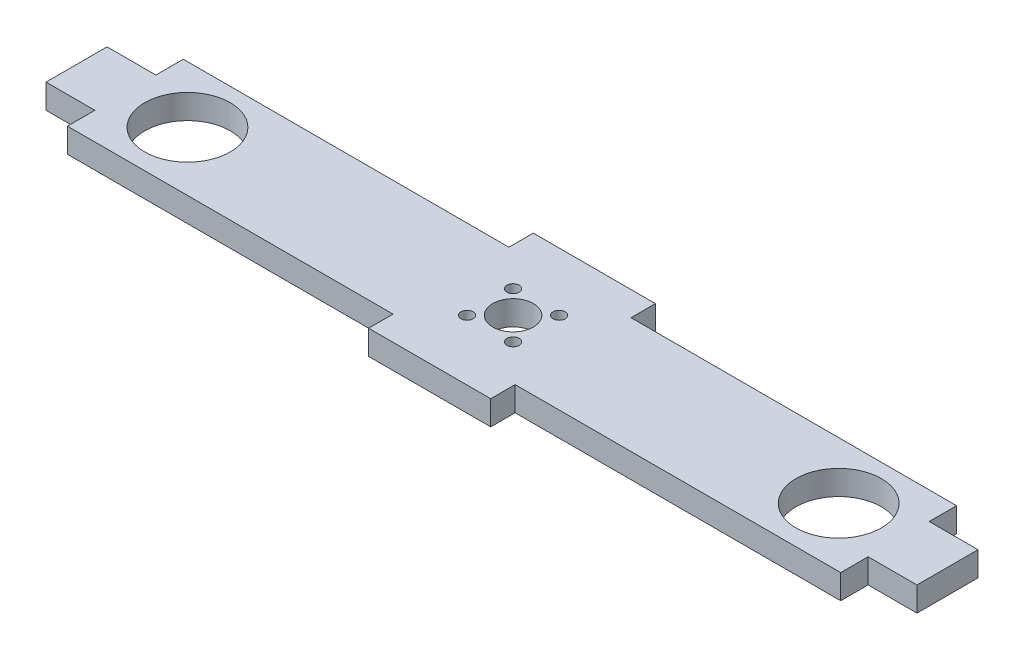
ISO-10303-21;
HEADER;
FILE_DESCRIPTION(('STEP AP214'),'2;1');
FILE_NAME('part.step','',(''),(''),'','','');
FILE_SCHEMA(('AUTOMOTIVE_DESIGN { 1 0 10303 214 1 1 1 1 }'));
ENDSEC;
DATA;
#1=APPLICATION_CONTEXT('core data for automotive mechanical design processes');
#2=APPLICATION_PROTOCOL_DEFINITION('international standard','automotive_design',2000,#1);
#3=PRODUCT_CONTEXT('',#1,'mechanical');
#4=PRODUCT('Part','Part','',(#3));
#5=PRODUCT_RELATED_PRODUCT_CATEGORY('part','',(#4));
#6=PRODUCT_DEFINITION_FORMATION('','',#4);
#7=PRODUCT_DEFINITION_CONTEXT('part definition',#1,'design');
#8=PRODUCT_DEFINITION('design','',#6,#7);
#9=PRODUCT_DEFINITION_SHAPE('','',#8);
#10=(LENGTH_UNIT() NAMED_UNIT(*) SI_UNIT(.MILLI.,.METRE.));
#11=(NAMED_UNIT(*) PLANE_ANGLE_UNIT() SI_UNIT($,.RADIAN.));
#12=(NAMED_UNIT(*) SI_UNIT($,.STERADIAN.) SOLID_ANGLE_UNIT());
#13=UNCERTAINTY_MEASURE_WITH_UNIT(LENGTH_MEASURE(1.E-05),#10,'distance_accuracy_value','');
#14=(GEOMETRIC_REPRESENTATION_CONTEXT(3) GLOBAL_UNCERTAINTY_ASSIGNED_CONTEXT((#13)) GLOBAL_UNIT_ASSIGNED_CONTEXT((#10,
#11,#12)) REPRESENTATION_CONTEXT('',''));
#15=CARTESIAN_POINT('',(0.,0.,0.));
#16=DIRECTION('',(0.,0.,1.));
#17=DIRECTION('',(1.,0.,0.));
#18=AXIS2_PLACEMENT_3D('',#15,#16,#17);
#19=CARTESIAN_POINT('',(0.,6.,0.));
#20=DIRECTION('',(0.,1.,0.));
#21=DIRECTION('',(0.,0.,1.));
#22=AXIS2_PLACEMENT_3D('',#19,#20,#21);
#23=PLANE('',#22);
#24=CARTESIAN_POINT('',(5.65685424949239,6.,5.39185424949239));
#25=DIRECTION('',(0.,1.,0.));
#26=DIRECTION('',(0.,0.,1.));
#27=AXIS2_PLACEMENT_3D('',#24,#25,#26);
#28=CIRCLE('',#27,1.5);
#29=CARTESIAN_POINT('',(5.65685424949239,6.,6.89185424949239));
#30=VERTEX_POINT('',#29);
#31=EDGE_CURVE('E409',#30,#30,#28,.T.);
#32=ORIENTED_EDGE('',*,*,#31,.F.);
#33=EDGE_LOOP('',(#32));
#34=FACE_BOUND('',#33,.T.);
#35=CARTESIAN_POINT('',(-5.65685424949238,6.,-5.92185424949236));
#36=DIRECTION('',(0.,1.,0.));
#37=DIRECTION('',(0.,0.,1.));
#38=AXIS2_PLACEMENT_3D('',#35,#36,#37);
#39=CIRCLE('',#38,1.5);
#40=CARTESIAN_POINT('',(-5.65685424949238,6.,-4.42185424949236));
#41=VERTEX_POINT('',#40);
#42=EDGE_CURVE('E421',#41,#41,#39,.T.);
#43=ORIENTED_EDGE('',*,*,#42,.F.);
#44=EDGE_LOOP('',(#43));
#45=FACE_BOUND('',#44,.T.);
#46=CARTESIAN_POINT('',(-80.,6.,-0.264999999999977));
#47=DIRECTION('',(0.,1.,0.));
#48=DIRECTION('',(0.,0.,1.));
#49=AXIS2_PLACEMENT_3D('',#46,#47,#48);
#50=CIRCLE('',#49,10.5);
#51=CARTESIAN_POINT('',(-80.,6.,10.235));
#52=VERTEX_POINT('',#51);
#53=EDGE_CURVE('E433',#52,#52,#50,.T.);
#54=ORIENTED_EDGE('',*,*,#53,.F.);
#55=EDGE_LOOP('',(#54));
#56=FACE_BOUND('',#55,.T.);
#57=DIRECTION('',(0.,0.,-1.));
#58=VECTOR('',#57,1.);
#59=CARTESIAN_POINT('',(95.,6.,7.5));
#60=LINE('',#59,#58);
#61=CARTESIAN_POINT('',(95.,6.,14.235));
#62=VERTEX_POINT('',#61);
#63=CARTESIAN_POINT('',(95.,6.,7.5));
#64=VERTEX_POINT('',#63);
#65=EDGE_CURVE('E243',#62,#64,#60,.T.);
#66=ORIENTED_EDGE('',*,*,#65,.T.);
#67=DIRECTION('',(1.,0.,0.));
#68=VECTOR('',#67,1.);
#69=CARTESIAN_POINT('',(95.,6.,7.5));
#70=LINE('',#69,#68);
#71=CARTESIAN_POINT('',(107.,6.,7.5));
#72=VERTEX_POINT('',#71);
#73=EDGE_CURVE('E131',#64,#72,#70,.T.);
#74=ORIENTED_EDGE('',*,*,#73,.T.);
#75=DIRECTION('',(0.,0.,-1.));
#76=VECTOR('',#75,1.);
#77=CARTESIAN_POINT('',(107.,6.,-7.5));
#78=LINE('',#77,#76);
#79=CARTESIAN_POINT('',(107.,6.,-7.5));
#80=VERTEX_POINT('',#79);
#81=EDGE_CURVE('E294',#72,#80,#78,.T.);
#82=ORIENTED_EDGE('',*,*,#81,.T.);
#83=DIRECTION('',(-1.,0.,0.));
#84=VECTOR('',#83,1.);
#85=CARTESIAN_POINT('',(95.,6.,-7.5));
#86=LINE('',#85,#84);
#87=CARTESIAN_POINT('',(95.,6.,-7.5));
#88=VERTEX_POINT('',#87);
#89=EDGE_CURVE('E313',#80,#88,#86,.T.);
#90=ORIENTED_EDGE('',*,*,#89,.T.);
#91=DIRECTION('',(0.,0.,-1.));
#92=VECTOR('',#91,1.);
#93=CARTESIAN_POINT('',(95.,6.,-14.235));
#94=LINE('',#93,#92);
#95=CARTESIAN_POINT('',(95.,6.,-14.235));
#96=VERTEX_POINT('',#95);
#97=EDGE_CURVE('E310',#88,#96,#94,.T.);
#98=ORIENTED_EDGE('',*,*,#97,.T.);
#99=DIRECTION('',(-1.,0.,0.));
#100=VECTOR('',#99,1.);
#101=CARTESIAN_POINT('',(15.,6.,-14.235));
#102=LINE('',#101,#100);
#103=CARTESIAN_POINT('',(15.,6.,-14.235));
#104=VERTEX_POINT('',#103);
#105=EDGE_CURVE('E312',#96,#104,#102,.T.);
#106=ORIENTED_EDGE('',*,*,#105,.T.);
#107=DIRECTION('',(0.,0.,-1.));
#108=VECTOR('',#107,1.);
#109=CARTESIAN_POINT('',(15.,6.,-20.235));
#110=LINE('',#109,#108);
#111=CARTESIAN_POINT('',(15.,6.,-20.235));
#112=VERTEX_POINT('',#111);
#113=EDGE_CURVE('E315',#104,#112,#110,.T.);
#114=ORIENTED_EDGE('',*,*,#113,.T.);
#115=DIRECTION('',(-1.,0.,0.));
#116=VECTOR('',#115,1.);
#117=CARTESIAN_POINT('',(-15.,6.,-20.235));
#118=LINE('',#117,#116);
#119=CARTESIAN_POINT('',(-15.,6.,-20.235));
#120=VERTEX_POINT('',#119);
#121=EDGE_CURVE('E321',#112,#120,#118,.T.);
#122=ORIENTED_EDGE('',*,*,#121,.T.);
#123=DIRECTION('',(0.,0.,1.));
#124=VECTOR('',#123,1.);
#125=CARTESIAN_POINT('',(-15.,6.,-20.235));
#126=LINE('',#125,#124);
#127=CARTESIAN_POINT('',(-15.,6.,-14.235));
#128=VERTEX_POINT('',#127);
#129=EDGE_CURVE('E323',#120,#128,#126,.T.);
#130=ORIENTED_EDGE('',*,*,#129,.T.);
#131=DIRECTION('',(-1.,0.,0.));
#132=VECTOR('',#131,1.);
#133=CARTESIAN_POINT('',(-95.,6.,-14.235));
#134=LINE('',#133,#132);
#135=CARTESIAN_POINT('',(-95.,6.,-14.235));
#136=VERTEX_POINT('',#135);
#137=EDGE_CURVE('E325',#128,#136,#134,.T.);
#138=ORIENTED_EDGE('',*,*,#137,.T.);
#139=DIRECTION('',(0.,0.,1.));
#140=VECTOR('',#139,1.);
#141=CARTESIAN_POINT('',(-95.,6.,-14.235));
#142=LINE('',#141,#140);
#143=CARTESIAN_POINT('',(-95.,6.,-7.49999999999997));
#144=VERTEX_POINT('',#143);
#145=EDGE_CURVE('E327',#136,#144,#142,.T.);
#146=ORIENTED_EDGE('',*,*,#145,.T.);
#147=DIRECTION('',(-1.,0.,0.));
#148=VECTOR('',#147,1.);
#149=CARTESIAN_POINT('',(-95.,6.,-7.49999999999997));
#150=LINE('',#149,#148);
#151=CARTESIAN_POINT('',(-107.,6.,-7.49999999999997));
#152=VERTEX_POINT('',#151);
#153=EDGE_CURVE('E329',#144,#152,#150,.T.);
#154=ORIENTED_EDGE('',*,*,#153,.T.);
#155=DIRECTION('',(0.,0.,1.));
#156=VECTOR('',#155,1.);
#157=CARTESIAN_POINT('',(-107.,6.,-7.49999999999997));
#158=LINE('',#157,#156);
#159=CARTESIAN_POINT('',(-107.,6.,7.50000000000003));
#160=VERTEX_POINT('',#159);
#161=EDGE_CURVE('E331',#152,#160,#158,.T.);
#162=ORIENTED_EDGE('',*,*,#161,.T.);
#163=DIRECTION('',(1.,0.,0.));
#164=VECTOR('',#163,1.);
#165=CARTESIAN_POINT('',(-95.,6.,7.50000000000003));
#166=LINE('',#165,#164);
#167=CARTESIAN_POINT('',(-95.,6.,7.50000000000003));
#168=VERTEX_POINT('',#167);
#169=EDGE_CURVE('E333',#160,#168,#166,.T.);
#170=ORIENTED_EDGE('',*,*,#169,.T.);
#171=DIRECTION('',(0.,0.,1.));
#172=VECTOR('',#171,1.);
#173=CARTESIAN_POINT('',(-95.,6.,7.50000000000003));
#174=LINE('',#173,#172);
#175=CARTESIAN_POINT('',(-95.,6.,14.235));
#176=VERTEX_POINT('',#175);
#177=EDGE_CURVE('E335',#168,#176,#174,.T.);
#178=ORIENTED_EDGE('',*,*,#177,.T.);
#179=DIRECTION('',(1.,0.,0.));
#180=VECTOR('',#179,1.);
#181=CARTESIAN_POINT('',(-95.,6.,14.235));
#182=LINE('',#181,#180);
#183=CARTESIAN_POINT('',(-15.,6.,14.235));
#184=VERTEX_POINT('',#183);
#185=EDGE_CURVE('E337',#176,#184,#182,.T.);
#186=ORIENTED_EDGE('',*,*,#185,.T.);
#187=DIRECTION('',(0.,0.,1.));
#188=VECTOR('',#187,1.);
#189=CARTESIAN_POINT('',(-15.,6.,14.235));
#190=LINE('',#189,#188);
#191=CARTESIAN_POINT('',(-15.,6.,20.235));
#192=VERTEX_POINT('',#191);
#193=EDGE_CURVE('E186',#184,#192,#190,.T.);
#194=ORIENTED_EDGE('',*,*,#193,.T.);
#195=DIRECTION('',(1.,0.,0.));
#196=VECTOR('',#195,1.);
#197=CARTESIAN_POINT('',(-15.,6.,20.235));
#198=LINE('',#197,#196);
#199=CARTESIAN_POINT('',(15.,6.,20.235));
#200=VERTEX_POINT('',#199);
#201=EDGE_CURVE('E180',#192,#200,#198,.T.);
#202=ORIENTED_EDGE('',*,*,#201,.T.);
#203=DIRECTION('',(0.,0.,-1.));
#204=VECTOR('',#203,1.);
#205=CARTESIAN_POINT('',(15.,6.,14.235));
#206=LINE('',#205,#204);
#207=CARTESIAN_POINT('',(15.,6.,14.235));
#208=VERTEX_POINT('',#207);
#209=EDGE_CURVE('E184',#200,#208,#206,.T.);
#210=ORIENTED_EDGE('',*,*,#209,.T.);
#211=DIRECTION('',(1.,0.,0.));
#212=VECTOR('',#211,1.);
#213=CARTESIAN_POINT('',(15.,6.,14.235));
#214=LINE('',#213,#212);
#215=EDGE_CURVE('E52',#208,#62,#214,.T.);
#216=ORIENTED_EDGE('',*,*,#215,.T.);
#217=EDGE_LOOP('',(#66,#74,#82,#90,#98,#106,#114,#122,#130,#138,#146,#154,#162,#170,#178,#186,
#194,#202,#210,#216));
#218=FACE_BOUND('',#217,.T.);
#219=CARTESIAN_POINT('',(0.,6.,-0.264999999999987));
#220=DIRECTION('',(0.,1.,0.));
#221=DIRECTION('',(0.,0.,1.));
#222=AXIS2_PLACEMENT_3D('',#219,#220,#221);
#223=CIRCLE('',#222,5.);
#224=CARTESIAN_POINT('',(0.,6.,4.73500000000001));
#225=VERTEX_POINT('',#224);
#226=EDGE_CURVE('E208',#225,#225,#223,.T.);
#227=ORIENTED_EDGE('',*,*,#226,.F.);
#228=EDGE_LOOP('',(#227));
#229=FACE_BOUND('',#228,.T.);
#230=CARTESIAN_POINT('',(80.,6.,-0.264999999999977));
#231=DIRECTION('',(0.,1.,0.));
#232=DIRECTION('',(0.,0.,-1.));
#233=AXIS2_PLACEMENT_3D('',#230,#231,#232);
#234=CIRCLE('',#233,10.5);
#235=CARTESIAN_POINT('',(80.,6.,-10.765));
#236=VERTEX_POINT('',#235);
#237=EDGE_CURVE('E427',#236,#236,#234,.T.);
#238=ORIENTED_EDGE('',*,*,#237,.F.);
#239=EDGE_LOOP('',(#238));
#240=FACE_BOUND('',#239,.T.);
#241=CARTESIAN_POINT('',(5.65685424949239,6.,-5.92185424949237));
#242=DIRECTION('',(0.,1.,0.));
#243=DIRECTION('',(0.,0.,-1.));
#244=AXIS2_PLACEMENT_3D('',#241,#242,#243);
#245=CIRCLE('',#244,1.5);
#246=CARTESIAN_POINT('',(5.65685424949239,6.,-7.42185424949237));
#247=VERTEX_POINT('',#246);
#248=EDGE_CURVE('E415',#247,#247,#245,.T.);
#249=ORIENTED_EDGE('',*,*,#248,.F.);
#250=EDGE_LOOP('',(#249));
#251=FACE_BOUND('',#250,.T.);
#252=CARTESIAN_POINT('',(-5.65685424949238,6.,5.39185424949239));
#253=DIRECTION('',(0.,1.,0.));
#254=DIRECTION('',(0.,0.,-1.));
#255=AXIS2_PLACEMENT_3D('',#252,#253,#254);
#256=CIRCLE('',#255,1.5);
#257=CARTESIAN_POINT('',(-5.65685424949238,6.,3.89185424949239));
#258=VERTEX_POINT('',#257);
#259=EDGE_CURVE('E400',#258,#258,#256,.T.);
#260=ORIENTED_EDGE('',*,*,#259,.F.);
#261=EDGE_LOOP('',(#260));
#262=FACE_BOUND('',#261,.T.);
#263=ADVANCED_FACE('F35',(#34,#45,#56,#218,#229,#240,#251,#262),#23,.T.);
#264=CARTESIAN_POINT('',(0.,0.,0.));
#265=DIRECTION('',(0.,1.,0.));
#266=DIRECTION('',(0.,0.,1.));
#267=AXIS2_PLACEMENT_3D('',#264,#265,#266);
#268=PLANE('',#267);
#269=DIRECTION('',(0.,0.,-1.));
#270=VECTOR('',#269,1.);
#271=CARTESIAN_POINT('',(95.,0.,7.5));
#272=LINE('',#271,#270);
#273=CARTESIAN_POINT('',(95.,0.,14.235));
#274=VERTEX_POINT('',#273);
#275=CARTESIAN_POINT('',(95.,0.,7.5));
#276=VERTEX_POINT('',#275);
#277=EDGE_CURVE('E204',#274,#276,#272,.T.);
#278=ORIENTED_EDGE('',*,*,#277,.F.);
#279=DIRECTION('',(1.,0.,0.));
#280=VECTOR('',#279,1.);
#281=CARTESIAN_POINT('',(15.,0.,14.235));
#282=LINE('',#281,#280);
#283=CARTESIAN_POINT('',(15.,0.,14.235));
#284=VERTEX_POINT('',#283);
#285=EDGE_CURVE('E123',#284,#274,#282,.T.);
#286=ORIENTED_EDGE('',*,*,#285,.F.);
#287=DIRECTION('',(0.,0.,-1.));
#288=VECTOR('',#287,1.);
#289=CARTESIAN_POINT('',(15.,0.,14.235));
#290=LINE('',#289,#288);
#291=CARTESIAN_POINT('',(15.,0.,20.235));
#292=VERTEX_POINT('',#291);
#293=EDGE_CURVE('E117',#292,#284,#290,.T.);
#294=ORIENTED_EDGE('',*,*,#293,.F.);
#295=DIRECTION('',(1.,0.,0.));
#296=VECTOR('',#295,1.);
#297=CARTESIAN_POINT('',(-15.,0.,20.235));
#298=LINE('',#297,#296);
#299=CARTESIAN_POINT('',(-15.,0.,20.235));
#300=VERTEX_POINT('',#299);
#301=EDGE_CURVE('E194',#300,#292,#298,.T.);
#302=ORIENTED_EDGE('',*,*,#301,.F.);
#303=DIRECTION('',(0.,0.,1.));
#304=VECTOR('',#303,1.);
#305=CARTESIAN_POINT('',(-15.,0.,14.235));
#306=LINE('',#305,#304);
#307=CARTESIAN_POINT('',(-15.,0.,14.235));
#308=VERTEX_POINT('',#307);
#309=EDGE_CURVE('E238',#308,#300,#306,.T.);
#310=ORIENTED_EDGE('',*,*,#309,.F.);
#311=DIRECTION('',(1.,0.,0.));
#312=VECTOR('',#311,1.);
#313=CARTESIAN_POINT('',(-95.,0.,14.235));
#314=LINE('',#313,#312);
#315=CARTESIAN_POINT('',(-95.,0.,14.235));
#316=VERTEX_POINT('',#315);
#317=EDGE_CURVE('E236',#316,#308,#314,.T.);
#318=ORIENTED_EDGE('',*,*,#317,.F.);
#319=DIRECTION('',(0.,0.,1.));
#320=VECTOR('',#319,1.);
#321=CARTESIAN_POINT('',(-95.,0.,7.50000000000003));
#322=LINE('',#321,#320);
#323=CARTESIAN_POINT('',(-95.,0.,7.50000000000003));
#324=VERTEX_POINT('',#323);
#325=EDGE_CURVE('E234',#324,#316,#322,.T.);
#326=ORIENTED_EDGE('',*,*,#325,.F.);
#327=DIRECTION('',(1.,0.,0.));
#328=VECTOR('',#327,1.);
#329=CARTESIAN_POINT('',(-95.,0.,7.50000000000003));
#330=LINE('',#329,#328);
#331=CARTESIAN_POINT('',(-107.,0.,7.50000000000003));
#332=VERTEX_POINT('',#331);
#333=EDGE_CURVE('E232',#332,#324,#330,.T.);
#334=ORIENTED_EDGE('',*,*,#333,.F.);
#335=DIRECTION('',(0.,0.,1.));
#336=VECTOR('',#335,1.);
#337=CARTESIAN_POINT('',(-107.,0.,-7.49999999999997));
#338=LINE('',#337,#336);
#339=CARTESIAN_POINT('',(-107.,0.,-7.49999999999997));
#340=VERTEX_POINT('',#339);
#341=EDGE_CURVE('E230',#340,#332,#338,.T.);
#342=ORIENTED_EDGE('',*,*,#341,.F.);
#343=DIRECTION('',(-1.,0.,0.));
#344=VECTOR('',#343,1.);
#345=CARTESIAN_POINT('',(-95.,0.,-7.49999999999997));
#346=LINE('',#345,#344);
#347=CARTESIAN_POINT('',(-95.,0.,-7.49999999999997));
#348=VERTEX_POINT('',#347);
#349=EDGE_CURVE('E228',#348,#340,#346,.T.);
#350=ORIENTED_EDGE('',*,*,#349,.F.);
#351=DIRECTION('',(0.,0.,1.));
#352=VECTOR('',#351,1.);
#353=CARTESIAN_POINT('',(-95.,0.,-14.235));
#354=LINE('',#353,#352);
#355=CARTESIAN_POINT('',(-95.,0.,-14.235));
#356=VERTEX_POINT('',#355);
#357=EDGE_CURVE('E226',#356,#348,#354,.T.);
#358=ORIENTED_EDGE('',*,*,#357,.F.);
#359=DIRECTION('',(-1.,0.,0.));
#360=VECTOR('',#359,1.);
#361=CARTESIAN_POINT('',(-95.,0.,-14.235));
#362=LINE('',#361,#360);
#363=CARTESIAN_POINT('',(-15.,0.,-14.235));
#364=VERTEX_POINT('',#363);
#365=EDGE_CURVE('E224',#364,#356,#362,.T.);
#366=ORIENTED_EDGE('',*,*,#365,.F.);
#367=DIRECTION('',(0.,0.,1.));
#368=VECTOR('',#367,1.);
#369=CARTESIAN_POINT('',(-15.,0.,-20.235));
#370=LINE('',#369,#368);
#371=CARTESIAN_POINT('',(-15.,0.,-20.235));
#372=VERTEX_POINT('',#371);
#373=EDGE_CURVE('E222',#372,#364,#370,.T.);
#374=ORIENTED_EDGE('',*,*,#373,.F.);
#375=DIRECTION('',(-1.,0.,0.));
#376=VECTOR('',#375,1.);
#377=CARTESIAN_POINT('',(-15.,0.,-20.235));
#378=LINE('',#377,#376);
#379=CARTESIAN_POINT('',(15.,0.,-20.235));
#380=VERTEX_POINT('',#379);
#381=EDGE_CURVE('E220',#380,#372,#378,.T.);
#382=ORIENTED_EDGE('',*,*,#381,.F.);
#383=DIRECTION('',(0.,0.,-1.));
#384=VECTOR('',#383,1.);
#385=CARTESIAN_POINT('',(15.,0.,-20.235));
#386=LINE('',#385,#384);
#387=CARTESIAN_POINT('',(15.,0.,-14.235));
#388=VERTEX_POINT('',#387);
#389=EDGE_CURVE('E218',#388,#380,#386,.T.);
#390=ORIENTED_EDGE('',*,*,#389,.F.);
#391=DIRECTION('',(-1.,0.,0.));
#392=VECTOR('',#391,1.);
#393=CARTESIAN_POINT('',(15.,0.,-14.235));
#394=LINE('',#393,#392);
#395=CARTESIAN_POINT('',(95.,0.,-14.235));
#396=VERTEX_POINT('',#395);
#397=EDGE_CURVE('E216',#396,#388,#394,.T.);
#398=ORIENTED_EDGE('',*,*,#397,.F.);
#399=DIRECTION('',(0.,0.,-1.));
#400=VECTOR('',#399,1.);
#401=CARTESIAN_POINT('',(95.,0.,-14.235));
#402=LINE('',#401,#400);
#403=CARTESIAN_POINT('',(95.,0.,-7.5));
#404=VERTEX_POINT('',#403);
#405=EDGE_CURVE('E214',#404,#396,#402,.T.);
#406=ORIENTED_EDGE('',*,*,#405,.F.);
#407=DIRECTION('',(-1.,0.,0.));
#408=VECTOR('',#407,1.);
#409=CARTESIAN_POINT('',(95.,0.,-7.5));
#410=LINE('',#409,#408);
#411=CARTESIAN_POINT('',(107.,0.,-7.5));
#412=VERTEX_POINT('',#411);
#413=EDGE_CURVE('E212',#412,#404,#410,.T.);
#414=ORIENTED_EDGE('',*,*,#413,.F.);
#415=DIRECTION('',(0.,0.,-1.));
#416=VECTOR('',#415,1.);
#417=CARTESIAN_POINT('',(107.,0.,-7.5));
#418=LINE('',#417,#416);
#419=CARTESIAN_POINT('',(107.,0.,7.5));
#420=VERTEX_POINT('',#419);
#421=EDGE_CURVE('E210',#420,#412,#418,.T.);
#422=ORIENTED_EDGE('',*,*,#421,.F.);
#423=DIRECTION('',(1.,0.,0.));
#424=VECTOR('',#423,1.);
#425=CARTESIAN_POINT('',(95.,0.,7.5));
#426=LINE('',#425,#424);
#427=EDGE_CURVE('E207',#276,#420,#426,.T.);
#428=ORIENTED_EDGE('',*,*,#427,.F.);
#429=EDGE_LOOP('',(#278,#286,#294,#302,#310,#318,#326,#334,#342,#350,#358,#366,#374,#382,#390,
#398,#406,#414,#422,#428));
#430=FACE_BOUND('',#429,.T.);
#431=CARTESIAN_POINT('',(0.,0.,-0.264999999999987));
#432=DIRECTION('',(0.,1.,0.));
#433=DIRECTION('',(0.,0.,1.));
#434=AXIS2_PLACEMENT_3D('',#431,#432,#433);
#435=CIRCLE('',#434,5.);
#436=CARTESIAN_POINT('',(0.,0.,4.73500000000001));
#437=VERTEX_POINT('',#436);
#438=EDGE_CURVE('E436',#437,#437,#435,.T.);
#439=ORIENTED_EDGE('',*,*,#438,.T.);
#440=EDGE_LOOP('',(#439));
#441=FACE_BOUND('',#440,.T.);
#442=CARTESIAN_POINT('',(-80.,0.,-0.264999999999977));
#443=DIRECTION('',(0.,1.,0.));
#444=DIRECTION('',(0.,0.,1.));
#445=AXIS2_PLACEMENT_3D('',#442,#443,#444);
#446=CIRCLE('',#445,10.5);
#447=CARTESIAN_POINT('',(-80.,0.,10.235));
#448=VERTEX_POINT('',#447);
#449=EDGE_CURVE('E430',#448,#448,#446,.T.);
#450=ORIENTED_EDGE('',*,*,#449,.T.);
#451=EDGE_LOOP('',(#450));
#452=FACE_BOUND('',#451,.T.);
#453=CARTESIAN_POINT('',(80.,0.,-0.264999999999977));
#454=DIRECTION('',(0.,1.,0.));
#455=DIRECTION('',(0.,0.,-1.));
#456=AXIS2_PLACEMENT_3D('',#453,#454,#455);
#457=CIRCLE('',#456,10.5);
#458=CARTESIAN_POINT('',(80.,0.,-10.765));
#459=VERTEX_POINT('',#458);
#460=EDGE_CURVE('E424',#459,#459,#457,.T.);
#461=ORIENTED_EDGE('',*,*,#460,.T.);
#462=EDGE_LOOP('',(#461));
#463=FACE_BOUND('',#462,.T.);
#464=CARTESIAN_POINT('',(-5.65685424949238,0.,-5.92185424949236));
#465=DIRECTION('',(0.,1.,0.));
#466=DIRECTION('',(0.,0.,1.));
#467=AXIS2_PLACEMENT_3D('',#464,#465,#466);
#468=CIRCLE('',#467,1.5);
#469=CARTESIAN_POINT('',(-5.65685424949238,0.,-4.42185424949236));
#470=VERTEX_POINT('',#469);
#471=EDGE_CURVE('E418',#470,#470,#468,.T.);
#472=ORIENTED_EDGE('',*,*,#471,.T.);
#473=EDGE_LOOP('',(#472));
#474=FACE_BOUND('',#473,.T.);
#475=CARTESIAN_POINT('',(5.65685424949239,0.,-5.92185424949237));
#476=DIRECTION('',(0.,1.,0.));
#477=DIRECTION('',(0.,0.,-1.));
#478=AXIS2_PLACEMENT_3D('',#475,#476,#477);
#479=CIRCLE('',#478,1.5);
#480=CARTESIAN_POINT('',(5.65685424949239,0.,-7.42185424949237));
#481=VERTEX_POINT('',#480);
#482=EDGE_CURVE('E412',#481,#481,#479,.T.);
#483=ORIENTED_EDGE('',*,*,#482,.T.);
#484=EDGE_LOOP('',(#483));
#485=FACE_BOUND('',#484,.T.);
#486=CARTESIAN_POINT('',(5.65685424949239,0.,5.39185424949239));
#487=DIRECTION('',(0.,1.,0.));
#488=DIRECTION('',(0.,0.,1.));
#489=AXIS2_PLACEMENT_3D('',#486,#487,#488);
#490=CIRCLE('',#489,1.5);
#491=CARTESIAN_POINT('',(5.65685424949239,0.,6.89185424949239));
#492=VERTEX_POINT('',#491);
#493=EDGE_CURVE('E406',#492,#492,#490,.T.);
#494=ORIENTED_EDGE('',*,*,#493,.T.);
#495=EDGE_LOOP('',(#494));
#496=FACE_BOUND('',#495,.T.);
#497=CARTESIAN_POINT('',(-5.65685424949238,0.,5.39185424949239));
#498=DIRECTION('',(0.,1.,0.));
#499=DIRECTION('',(0.,0.,-1.));
#500=AXIS2_PLACEMENT_3D('',#497,#498,#499);
#501=CIRCLE('',#500,1.5);
#502=CARTESIAN_POINT('',(-5.65685424949238,0.,3.89185424949239));
#503=VERTEX_POINT('',#502);
#504=EDGE_CURVE('E403',#503,#503,#501,.T.);
#505=ORIENTED_EDGE('',*,*,#504,.T.);
#506=EDGE_LOOP('',(#505));
#507=FACE_BOUND('',#506,.T.);
#508=ADVANCED_FACE('F298',(#430,#441,#452,#463,#474,#485,#496,#507),#268,.F.);
#509=CARTESIAN_POINT('',(95.,6.,7.5));
#510=DIRECTION('',(-1.,0.,0.));
#511=DIRECTION('',(0.,0.,1.));
#512=AXIS2_PLACEMENT_3D('',#509,#510,#511);
#513=PLANE('',#512);
#514=ORIENTED_EDGE('',*,*,#277,.T.);
#515=DIRECTION('',(0.,-1.,0.));
#516=VECTOR('',#515,1.);
#517=CARTESIAN_POINT('',(95.,6.,7.5));
#518=LINE('',#517,#516);
#519=EDGE_CURVE('E11',#64,#276,#518,.T.);
#520=ORIENTED_EDGE('',*,*,#519,.F.);
#521=ORIENTED_EDGE('',*,*,#65,.F.);
#522=DIRECTION('',(0.,-1.,0.));
#523=VECTOR('',#522,1.);
#524=CARTESIAN_POINT('',(95.,6.,14.235));
#525=LINE('',#524,#523);
#526=EDGE_CURVE('E200',#62,#274,#525,.T.);
#527=ORIENTED_EDGE('',*,*,#526,.T.);
#528=EDGE_LOOP('',(#514,#520,#521,#527));
#529=FACE_BOUND('',#528,.T.);
#530=ADVANCED_FACE('F37',(#529),#513,.F.);
#531=CARTESIAN_POINT('',(95.,6.,7.5));
#532=DIRECTION('',(0.,0.,-1.));
#533=DIRECTION('',(-1.,0.,0.));
#534=AXIS2_PLACEMENT_3D('',#531,#532,#533);
#535=PLANE('',#534);
#536=ORIENTED_EDGE('',*,*,#427,.T.);
#537=DIRECTION('',(0.,-1.,0.));
#538=VECTOR('',#537,1.);
#539=CARTESIAN_POINT('',(107.,6.,7.5));
#540=LINE('',#539,#538);
#541=EDGE_CURVE('E44',#72,#420,#540,.T.);
#542=ORIENTED_EDGE('',*,*,#541,.F.);
#543=ORIENTED_EDGE('',*,*,#73,.F.);
#544=ORIENTED_EDGE('',*,*,#519,.T.);
#545=EDGE_LOOP('',(#536,#542,#543,#544));
#546=FACE_BOUND('',#545,.T.);
#547=ADVANCED_FACE('F653',(#546),#535,.F.);
#548=CARTESIAN_POINT('',(107.,6.,-7.5));
#549=DIRECTION('',(-1.,0.,0.));
#550=DIRECTION('',(0.,0.,1.));
#551=AXIS2_PLACEMENT_3D('',#548,#549,#550);
#552=PLANE('',#551);
#553=ORIENTED_EDGE('',*,*,#421,.T.);
#554=DIRECTION('',(0.,-1.,0.));
#555=VECTOR('',#554,1.);
#556=CARTESIAN_POINT('',(107.,6.,-7.5));
#557=LINE('',#556,#555);
#558=EDGE_CURVE('E286',#80,#412,#557,.T.);
#559=ORIENTED_EDGE('',*,*,#558,.F.);
#560=ORIENTED_EDGE('',*,*,#81,.F.);
#561=ORIENTED_EDGE('',*,*,#541,.T.);
#562=EDGE_LOOP('',(#553,#559,#560,#561));
#563=FACE_BOUND('',#562,.T.);
#564=ADVANCED_FACE('F292',(#563),#552,.F.);
#565=CARTESIAN_POINT('',(95.,6.,-7.5));
#566=DIRECTION('',(0.,0.,1.));
#567=DIRECTION('',(1.,0.,0.));
#568=AXIS2_PLACEMENT_3D('',#565,#566,#567);
#569=PLANE('',#568);
#570=ORIENTED_EDGE('',*,*,#413,.T.);
#571=DIRECTION('',(0.,-1.,0.));
#572=VECTOR('',#571,1.);
#573=CARTESIAN_POINT('',(95.,6.,-7.5));
#574=LINE('',#573,#572);
#575=EDGE_CURVE('E283',#88,#404,#574,.T.);
#576=ORIENTED_EDGE('',*,*,#575,.F.);
#577=ORIENTED_EDGE('',*,*,#89,.F.);
#578=ORIENTED_EDGE('',*,*,#558,.T.);
#579=EDGE_LOOP('',(#570,#576,#577,#578));
#580=FACE_BOUND('',#579,.T.);
#581=ADVANCED_FACE('F304',(#580),#569,.F.);
#582=CARTESIAN_POINT('',(95.,6.,-14.235));
#583=DIRECTION('',(-1.,0.,0.));
#584=DIRECTION('',(0.,0.,1.));
#585=AXIS2_PLACEMENT_3D('',#582,#583,#584);
#586=PLANE('',#585);
#587=ORIENTED_EDGE('',*,*,#405,.T.);
#588=DIRECTION('',(0.,-1.,0.));
#589=VECTOR('',#588,1.);
#590=CARTESIAN_POINT('',(95.,6.,-14.235));
#591=LINE('',#590,#589);
#592=EDGE_CURVE('E280',#96,#396,#591,.T.);
#593=ORIENTED_EDGE('',*,*,#592,.F.);
#594=ORIENTED_EDGE('',*,*,#97,.F.);
#595=ORIENTED_EDGE('',*,*,#575,.T.);
#596=EDGE_LOOP('',(#587,#593,#594,#595));
#597=FACE_BOUND('',#596,.T.);
#598=ADVANCED_FACE('F308',(#597),#586,.F.);
#599=CARTESIAN_POINT('',(15.,6.,-14.235));
#600=DIRECTION('',(0.,0.,1.));
#601=DIRECTION('',(1.,0.,0.));
#602=AXIS2_PLACEMENT_3D('',#599,#600,#601);
#603=PLANE('',#602);
#604=ORIENTED_EDGE('',*,*,#397,.T.);
#605=DIRECTION('',(0.,-1.,0.));
#606=VECTOR('',#605,1.);
#607=CARTESIAN_POINT('',(15.,6.,-14.235));
#608=LINE('',#607,#606);
#609=EDGE_CURVE('E277',#104,#388,#608,.T.);
#610=ORIENTED_EDGE('',*,*,#609,.F.);
#611=ORIENTED_EDGE('',*,*,#105,.F.);
#612=ORIENTED_EDGE('',*,*,#592,.T.);
#613=EDGE_LOOP('',(#604,#610,#611,#612));
#614=FACE_BOUND('',#613,.T.);
#615=ADVANCED_FACE('F618',(#614),#603,.F.);
#616=CARTESIAN_POINT('',(15.,6.,-20.235));
#617=DIRECTION('',(-1.,0.,0.));
#618=DIRECTION('',(0.,0.,1.));
#619=AXIS2_PLACEMENT_3D('',#616,#617,#618);
#620=PLANE('',#619);
#621=ORIENTED_EDGE('',*,*,#389,.T.);
#622=DIRECTION('',(0.,-1.,0.));
#623=VECTOR('',#622,1.);
#624=CARTESIAN_POINT('',(15.,6.,-20.235));
#625=LINE('',#624,#623);
#626=EDGE_CURVE('E274',#112,#380,#625,.T.);
#627=ORIENTED_EDGE('',*,*,#626,.F.);
#628=ORIENTED_EDGE('',*,*,#113,.F.);
#629=ORIENTED_EDGE('',*,*,#609,.T.);
#630=EDGE_LOOP('',(#621,#627,#628,#629));
#631=FACE_BOUND('',#630,.T.);
#632=ADVANCED_FACE('F608',(#631),#620,.F.);
#633=CARTESIAN_POINT('',(-15.,6.,-20.235));
#634=DIRECTION('',(0.,0.,1.));
#635=DIRECTION('',(1.,0.,0.));
#636=AXIS2_PLACEMENT_3D('',#633,#634,#635);
#637=PLANE('',#636);
#638=ORIENTED_EDGE('',*,*,#381,.T.);
#639=DIRECTION('',(0.,-1.,0.));
#640=VECTOR('',#639,1.);
#641=CARTESIAN_POINT('',(-15.,6.,-20.235));
#642=LINE('',#641,#640);
#643=EDGE_CURVE('E271',#120,#372,#642,.T.);
#644=ORIENTED_EDGE('',*,*,#643,.F.);
#645=ORIENTED_EDGE('',*,*,#121,.F.);
#646=ORIENTED_EDGE('',*,*,#626,.T.);
#647=EDGE_LOOP('',(#638,#644,#645,#646));
#648=FACE_BOUND('',#647,.T.);
#649=ADVANCED_FACE('F598',(#648),#637,.F.);
#650=CARTESIAN_POINT('',(-15.,6.,-20.235));
#651=DIRECTION('',(1.,0.,0.));
#652=DIRECTION('',(0.,0.,-1.));
#653=AXIS2_PLACEMENT_3D('',#650,#651,#652);
#654=PLANE('',#653);
#655=ORIENTED_EDGE('',*,*,#373,.T.);
#656=DIRECTION('',(0.,-1.,0.));
#657=VECTOR('',#656,1.);
#658=CARTESIAN_POINT('',(-15.,6.,-14.235));
#659=LINE('',#658,#657);
#660=EDGE_CURVE('E268',#128,#364,#659,.T.);
#661=ORIENTED_EDGE('',*,*,#660,.F.);
#662=ORIENTED_EDGE('',*,*,#129,.F.);
#663=ORIENTED_EDGE('',*,*,#643,.T.);
#664=EDGE_LOOP('',(#655,#661,#662,#663));
#665=FACE_BOUND('',#664,.T.);
#666=ADVANCED_FACE('F588',(#665),#654,.F.);
#667=CARTESIAN_POINT('',(-95.,6.,-14.235));
#668=DIRECTION('',(0.,0.,1.));
#669=DIRECTION('',(1.,0.,0.));
#670=AXIS2_PLACEMENT_3D('',#667,#668,#669);
#671=PLANE('',#670);
#672=ORIENTED_EDGE('',*,*,#365,.T.);
#673=DIRECTION('',(0.,-1.,0.));
#674=VECTOR('',#673,1.);
#675=CARTESIAN_POINT('',(-95.,6.,-14.235));
#676=LINE('',#675,#674);
#677=EDGE_CURVE('E265',#136,#356,#676,.T.);
#678=ORIENTED_EDGE('',*,*,#677,.F.);
#679=ORIENTED_EDGE('',*,*,#137,.F.);
#680=ORIENTED_EDGE('',*,*,#660,.T.);
#681=EDGE_LOOP('',(#672,#678,#679,#680));
#682=FACE_BOUND('',#681,.T.);
#683=ADVANCED_FACE('F578',(#682),#671,.F.);
#684=CARTESIAN_POINT('',(-95.,6.,-14.235));
#685=DIRECTION('',(1.,0.,0.));
#686=DIRECTION('',(0.,0.,-1.));
#687=AXIS2_PLACEMENT_3D('',#684,#685,#686);
#688=PLANE('',#687);
#689=ORIENTED_EDGE('',*,*,#357,.T.);
#690=DIRECTION('',(0.,-1.,0.));
#691=VECTOR('',#690,1.);
#692=CARTESIAN_POINT('',(-95.,6.,-7.49999999999997));
#693=LINE('',#692,#691);
#694=EDGE_CURVE('E262',#144,#348,#693,.T.);
#695=ORIENTED_EDGE('',*,*,#694,.F.);
#696=ORIENTED_EDGE('',*,*,#145,.F.);
#697=ORIENTED_EDGE('',*,*,#677,.T.);
#698=EDGE_LOOP('',(#689,#695,#696,#697));
#699=FACE_BOUND('',#698,.T.);
#700=ADVANCED_FACE('F568',(#699),#688,.F.);
#701=CARTESIAN_POINT('',(-95.,6.,-7.49999999999997));
#702=DIRECTION('',(0.,0.,1.));
#703=DIRECTION('',(1.,0.,0.));
#704=AXIS2_PLACEMENT_3D('',#701,#702,#703);
#705=PLANE('',#704);
#706=ORIENTED_EDGE('',*,*,#349,.T.);
#707=DIRECTION('',(0.,-1.,0.));
#708=VECTOR('',#707,1.);
#709=CARTESIAN_POINT('',(-107.,6.,-7.49999999999997));
#710=LINE('',#709,#708);
#711=EDGE_CURVE('E259',#152,#340,#710,.T.);
#712=ORIENTED_EDGE('',*,*,#711,.F.);
#713=ORIENTED_EDGE('',*,*,#153,.F.);
#714=ORIENTED_EDGE('',*,*,#694,.T.);
#715=EDGE_LOOP('',(#706,#712,#713,#714));
#716=FACE_BOUND('',#715,.T.);
#717=ADVANCED_FACE('F558',(#716),#705,.F.);
#718=CARTESIAN_POINT('',(-107.,6.,-7.49999999999997));
#719=DIRECTION('',(1.,0.,0.));
#720=DIRECTION('',(0.,0.,-1.));
#721=AXIS2_PLACEMENT_3D('',#718,#719,#720);
#722=PLANE('',#721);
#723=ORIENTED_EDGE('',*,*,#341,.T.);
#724=DIRECTION('',(0.,-1.,0.));
#725=VECTOR('',#724,1.);
#726=CARTESIAN_POINT('',(-107.,6.,7.50000000000003));
#727=LINE('',#726,#725);
#728=EDGE_CURVE('E256',#160,#332,#727,.T.);
#729=ORIENTED_EDGE('',*,*,#728,.F.);
#730=ORIENTED_EDGE('',*,*,#161,.F.);
#731=ORIENTED_EDGE('',*,*,#711,.T.);
#732=EDGE_LOOP('',(#723,#729,#730,#731));
#733=FACE_BOUND('',#732,.T.);
#734=ADVANCED_FACE('F548',(#733),#722,.F.);
#735=CARTESIAN_POINT('',(-95.,6.,7.50000000000003));
#736=DIRECTION('',(0.,0.,-1.));
#737=DIRECTION('',(-1.,0.,0.));
#738=AXIS2_PLACEMENT_3D('',#735,#736,#737);
#739=PLANE('',#738);
#740=ORIENTED_EDGE('',*,*,#333,.T.);
#741=DIRECTION('',(0.,-1.,0.));
#742=VECTOR('',#741,1.);
#743=CARTESIAN_POINT('',(-95.,6.,7.50000000000003));
#744=LINE('',#743,#742);
#745=EDGE_CURVE('E253',#168,#324,#744,.T.);
#746=ORIENTED_EDGE('',*,*,#745,.F.);
#747=ORIENTED_EDGE('',*,*,#169,.F.);
#748=ORIENTED_EDGE('',*,*,#728,.T.);
#749=EDGE_LOOP('',(#740,#746,#747,#748));
#750=FACE_BOUND('',#749,.T.);
#751=ADVANCED_FACE('F538',(#750),#739,.F.);
#752=CARTESIAN_POINT('',(-95.,6.,7.50000000000003));
#753=DIRECTION('',(1.,0.,0.));
#754=DIRECTION('',(0.,0.,-1.));
#755=AXIS2_PLACEMENT_3D('',#752,#753,#754);
#756=PLANE('',#755);
#757=ORIENTED_EDGE('',*,*,#325,.T.);
#758=DIRECTION('',(0.,-1.,0.));
#759=VECTOR('',#758,1.);
#760=CARTESIAN_POINT('',(-95.,6.,14.235));
#761=LINE('',#760,#759);
#762=EDGE_CURVE('E250',#176,#316,#761,.T.);
#763=ORIENTED_EDGE('',*,*,#762,.F.);
#764=ORIENTED_EDGE('',*,*,#177,.F.);
#765=ORIENTED_EDGE('',*,*,#745,.T.);
#766=EDGE_LOOP('',(#757,#763,#764,#765));
#767=FACE_BOUND('',#766,.T.);
#768=ADVANCED_FACE('F529',(#767),#756,.F.);
#769=CARTESIAN_POINT('',(-95.,6.,14.235));
#770=DIRECTION('',(0.,0.,-1.));
#771=DIRECTION('',(-1.,0.,0.));
#772=AXIS2_PLACEMENT_3D('',#769,#770,#771);
#773=PLANE('',#772);
#774=ORIENTED_EDGE('',*,*,#317,.T.);
#775=DIRECTION('',(0.,-1.,0.));
#776=VECTOR('',#775,1.);
#777=CARTESIAN_POINT('',(-15.,6.,14.235));
#778=LINE('',#777,#776);
#779=EDGE_CURVE('E247',#184,#308,#778,.T.);
#780=ORIENTED_EDGE('',*,*,#779,.F.);
#781=ORIENTED_EDGE('',*,*,#185,.F.);
#782=ORIENTED_EDGE('',*,*,#762,.T.);
#783=EDGE_LOOP('',(#774,#780,#781,#782));
#784=FACE_BOUND('',#783,.T.);
#785=ADVANCED_FACE('F343',(#784),#773,.F.);
#786=CARTESIAN_POINT('',(-15.,6.,14.235));
#787=DIRECTION('',(1.,0.,0.));
#788=DIRECTION('',(0.,0.,-1.));
#789=AXIS2_PLACEMENT_3D('',#786,#787,#788);
#790=PLANE('',#789);
#791=ORIENTED_EDGE('',*,*,#309,.T.);
#792=DIRECTION('',(0.,-1.,0.));
#793=VECTOR('',#792,1.);
#794=CARTESIAN_POINT('',(-15.,6.,20.235));
#795=LINE('',#794,#793);
#796=EDGE_CURVE('E195',#192,#300,#795,.T.);
#797=ORIENTED_EDGE('',*,*,#796,.F.);
#798=ORIENTED_EDGE('',*,*,#193,.F.);
#799=ORIENTED_EDGE('',*,*,#779,.T.);
#800=EDGE_LOOP('',(#791,#797,#798,#799));
#801=FACE_BOUND('',#800,.T.);
#802=ADVANCED_FACE('F347',(#801),#790,.F.);
#803=CARTESIAN_POINT('',(-15.,6.,20.235));
#804=DIRECTION('',(0.,0.,-1.));
#805=DIRECTION('',(-1.,0.,0.));
#806=AXIS2_PLACEMENT_3D('',#803,#804,#805);
#807=PLANE('',#806);
#808=ORIENTED_EDGE('',*,*,#301,.T.);
#809=DIRECTION('',(0.,-1.,0.));
#810=VECTOR('',#809,1.);
#811=CARTESIAN_POINT('',(15.,6.,20.235));
#812=LINE('',#811,#810);
#813=EDGE_CURVE('E191',#200,#292,#812,.T.);
#814=ORIENTED_EDGE('',*,*,#813,.F.);
#815=ORIENTED_EDGE('',*,*,#201,.F.);
#816=ORIENTED_EDGE('',*,*,#796,.T.);
#817=EDGE_LOOP('',(#808,#814,#815,#816));
#818=FACE_BOUND('',#817,.T.);
#819=ADVANCED_FACE('F192',(#818),#807,.F.);
#820=CARTESIAN_POINT('',(15.,6.,14.235));
#821=DIRECTION('',(-1.,0.,0.));
#822=DIRECTION('',(0.,0.,1.));
#823=AXIS2_PLACEMENT_3D('',#820,#821,#822);
#824=PLANE('',#823);
#825=ORIENTED_EDGE('',*,*,#293,.T.);
#826=DIRECTION('',(0.,-1.,0.));
#827=VECTOR('',#826,1.);
#828=CARTESIAN_POINT('',(15.,6.,14.235));
#829=LINE('',#828,#827);
#830=EDGE_CURVE('E196',#208,#284,#829,.T.);
#831=ORIENTED_EDGE('',*,*,#830,.F.);
#832=ORIENTED_EDGE('',*,*,#209,.F.);
#833=ORIENTED_EDGE('',*,*,#813,.T.);
#834=EDGE_LOOP('',(#825,#831,#832,#833));
#835=FACE_BOUND('',#834,.T.);
#836=ADVANCED_FACE('F198',(#835),#824,.F.);
#837=CARTESIAN_POINT('',(15.,6.,14.235));
#838=DIRECTION('',(0.,0.,-1.));
#839=DIRECTION('',(-1.,0.,0.));
#840=AXIS2_PLACEMENT_3D('',#837,#838,#839);
#841=PLANE('',#840);
#842=ORIENTED_EDGE('',*,*,#285,.T.);
#843=ORIENTED_EDGE('',*,*,#526,.F.);
#844=ORIENTED_EDGE('',*,*,#215,.F.);
#845=ORIENTED_EDGE('',*,*,#830,.T.);
#846=EDGE_LOOP('',(#842,#843,#844,#845));
#847=FACE_BOUND('',#846,.T.);
#848=ADVANCED_FACE('F351',(#847),#841,.F.);
#849=CARTESIAN_POINT('',(0.,6.,-0.264999999999987));
#850=DIRECTION('',(0.,-1.,0.));
#851=DIRECTION('',(0.,0.,-1.));
#852=AXIS2_PLACEMENT_3D('',#849,#850,#851);
#853=CYLINDRICAL_SURFACE('',#852,5.);
#854=ORIENTED_EDGE('',*,*,#226,.T.);
#855=EDGE_LOOP('',(#854));
#856=FACE_BOUND('',#855,.T.);
#857=ORIENTED_EDGE('',*,*,#438,.F.);
#858=EDGE_LOOP('',(#857));
#859=FACE_BOUND('',#858,.T.);
#860=ADVANCED_FACE('F353',(#856,#859),#853,.F.);
#861=CARTESIAN_POINT('',(-80.,6.,-0.264999999999977));
#862=DIRECTION('',(0.,-1.,0.));
#863=DIRECTION('',(0.,0.,-1.));
#864=AXIS2_PLACEMENT_3D('',#861,#862,#863);
#865=CYLINDRICAL_SURFACE('',#864,10.5);
#866=ORIENTED_EDGE('',*,*,#53,.T.);
#867=EDGE_LOOP('',(#866));
#868=FACE_BOUND('',#867,.T.);
#869=ORIENTED_EDGE('',*,*,#449,.F.);
#870=EDGE_LOOP('',(#869));
#871=FACE_BOUND('',#870,.T.);
#872=ADVANCED_FACE('F359',(#868,#871),#865,.F.);
#873=CARTESIAN_POINT('',(80.,6.,-0.264999999999977));
#874=DIRECTION('',(0.,-1.,0.));
#875=DIRECTION('',(0.,0.,-1.));
#876=AXIS2_PLACEMENT_3D('',#873,#874,#875);
#877=CYLINDRICAL_SURFACE('',#876,10.5);
#878=ORIENTED_EDGE('',*,*,#237,.T.);
#879=EDGE_LOOP('',(#878));
#880=FACE_BOUND('',#879,.T.);
#881=ORIENTED_EDGE('',*,*,#460,.F.);
#882=EDGE_LOOP('',(#881));
#883=FACE_BOUND('',#882,.T.);
#884=ADVANCED_FACE('F375',(#880,#883),#877,.F.);
#885=CARTESIAN_POINT('',(-5.65685424949238,6.,-5.92185424949236));
#886=DIRECTION('',(0.,-1.,0.));
#887=DIRECTION('',(0.,0.,-1.));
#888=AXIS2_PLACEMENT_3D('',#885,#886,#887);
#889=CYLINDRICAL_SURFACE('',#888,1.5);
#890=ORIENTED_EDGE('',*,*,#42,.T.);
#891=EDGE_LOOP('',(#890));
#892=FACE_BOUND('',#891,.T.);
#893=ORIENTED_EDGE('',*,*,#471,.F.);
#894=EDGE_LOOP('',(#893));
#895=FACE_BOUND('',#894,.T.);
#896=ADVANCED_FACE('F379',(#892,#895),#889,.F.);
#897=CARTESIAN_POINT('',(5.65685424949239,6.,-5.92185424949237));
#898=DIRECTION('',(0.,-1.,0.));
#899=DIRECTION('',(0.,0.,-1.));
#900=AXIS2_PLACEMENT_3D('',#897,#898,#899);
#901=CYLINDRICAL_SURFACE('',#900,1.5);
#902=ORIENTED_EDGE('',*,*,#248,.T.);
#903=EDGE_LOOP('',(#902));
#904=FACE_BOUND('',#903,.T.);
#905=ORIENTED_EDGE('',*,*,#482,.F.);
#906=EDGE_LOOP('',(#905));
#907=FACE_BOUND('',#906,.T.);
#908=ADVANCED_FACE('F383',(#904,#907),#901,.F.);
#909=CARTESIAN_POINT('',(5.65685424949239,6.,5.39185424949239));
#910=DIRECTION('',(0.,-1.,0.));
#911=DIRECTION('',(0.,0.,-1.));
#912=AXIS2_PLACEMENT_3D('',#909,#910,#911);
#913=CYLINDRICAL_SURFACE('',#912,1.5);
#914=ORIENTED_EDGE('',*,*,#31,.T.);
#915=EDGE_LOOP('',(#914));
#916=FACE_BOUND('',#915,.T.);
#917=ORIENTED_EDGE('',*,*,#493,.F.);
#918=EDGE_LOOP('',(#917));
#919=FACE_BOUND('',#918,.T.);
#920=ADVANCED_FACE('F387',(#916,#919),#913,.F.);
#921=CARTESIAN_POINT('',(-5.65685424949238,6.,5.39185424949239));
#922=DIRECTION('',(0.,-1.,0.));
#923=DIRECTION('',(0.,0.,-1.));
#924=AXIS2_PLACEMENT_3D('',#921,#922,#923);
#925=CYLINDRICAL_SURFACE('',#924,1.5);
#926=ORIENTED_EDGE('',*,*,#259,.T.);
#927=EDGE_LOOP('',(#926));
#928=FACE_BOUND('',#927,.T.);
#929=ORIENTED_EDGE('',*,*,#504,.F.);
#930=EDGE_LOOP('',(#929));
#931=FACE_BOUND('',#930,.T.);
#932=ADVANCED_FACE('F391',(#928,#931),#925,.F.);
#933=CLOSED_SHELL('',(#263,#508,#530,#547,#564,#581,#598,#615,#632,#649,#666,#683,#700,#717,
#734,#751,#768,#785,#802,#819,#836,#848,#860,#872,#884,#896,#908,#920,#932));
#934=MANIFOLD_SOLID_BREP('B2',#933);
#935=ADVANCED_BREP_SHAPE_REPRESENTATION('',(#18,#934),#14);
#936=SHAPE_DEFINITION_REPRESENTATION(#9,#935);
ENDSEC;
END-ISO-10303-21;
